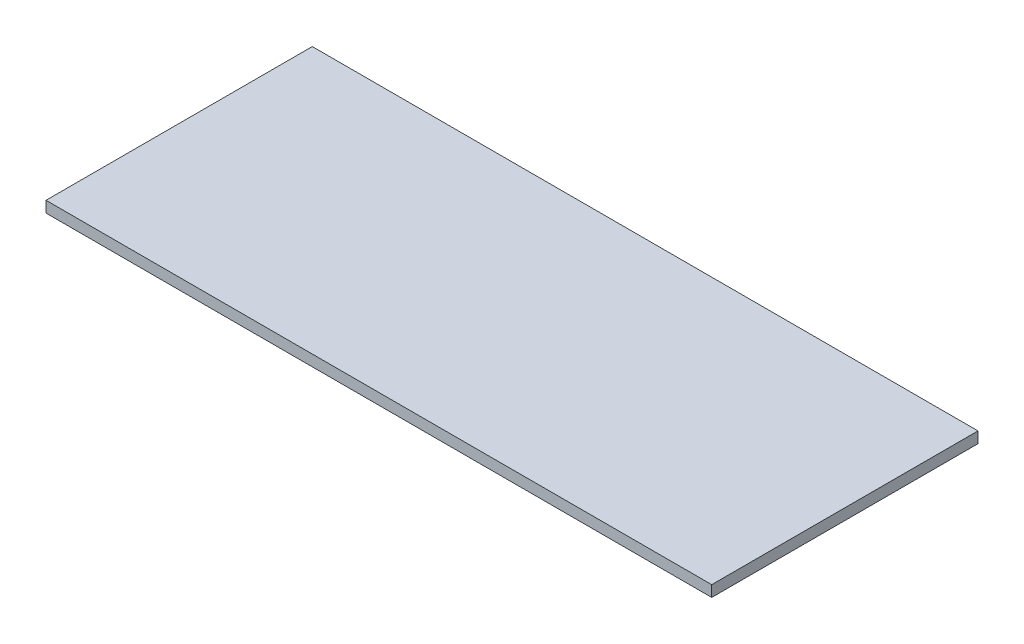
ISO-10303-21;
HEADER;
FILE_DESCRIPTION(('STEP AP214'),'2;1');
FILE_NAME('part.step','',(''),(''),'','','');
FILE_SCHEMA(('AUTOMOTIVE_DESIGN { 1 0 10303 214 1 1 1 1 }'));
ENDSEC;
DATA;
#1=APPLICATION_CONTEXT('core data for automotive mechanical design processes');
#2=APPLICATION_PROTOCOL_DEFINITION('international standard','automotive_design',2000,#1);
#3=PRODUCT_CONTEXT('',#1,'mechanical');
#4=PRODUCT('Part','Part','',(#3));
#5=PRODUCT_RELATED_PRODUCT_CATEGORY('part','',(#4));
#6=PRODUCT_DEFINITION_FORMATION('','',#4);
#7=PRODUCT_DEFINITION_CONTEXT('part definition',#1,'design');
#8=PRODUCT_DEFINITION('design','',#6,#7);
#9=PRODUCT_DEFINITION_SHAPE('','',#8);
#10=(LENGTH_UNIT() NAMED_UNIT(*) SI_UNIT(.MILLI.,.METRE.));
#11=(NAMED_UNIT(*) PLANE_ANGLE_UNIT() SI_UNIT($,.RADIAN.));
#12=(NAMED_UNIT(*) SI_UNIT($,.STERADIAN.) SOLID_ANGLE_UNIT());
#13=UNCERTAINTY_MEASURE_WITH_UNIT(LENGTH_MEASURE(1.E-05),#10,'distance_accuracy_value','');
#14=(GEOMETRIC_REPRESENTATION_CONTEXT(3) GLOBAL_UNCERTAINTY_ASSIGNED_CONTEXT((#13)) GLOBAL_UNIT_ASSIGNED_CONTEXT((#10,
#11,#12)) REPRESENTATION_CONTEXT('',''));
#15=CARTESIAN_POINT('',(0.,0.,0.));
#16=DIRECTION('',(0.,0.,1.));
#17=DIRECTION('',(1.,0.,0.));
#18=AXIS2_PLACEMENT_3D('',#15,#16,#17);
#19=CARTESIAN_POINT('',(19050.,635.,7620.));
#20=DIRECTION('',(-1.,0.,0.));
#21=DIRECTION('',(0.,0.,1.));
#22=AXIS2_PLACEMENT_3D('',#19,#20,#21);
#23=PLANE('',#22);
#24=DIRECTION('',(0.,0.,-1.));
#25=VECTOR('',#24,1.);
#26=CARTESIAN_POINT('',(19050.,0.,7620.));
#27=LINE('',#26,#25);
#28=CARTESIAN_POINT('',(19050.,0.,7620.));
#29=VERTEX_POINT('',#28);
#30=CARTESIAN_POINT('',(19050.,0.,-7620.));
#31=VERTEX_POINT('',#30);
#32=EDGE_CURVE('E107',#29,#31,#27,.T.);
#33=ORIENTED_EDGE('',*,*,#32,.T.);
#34=DIRECTION('',(0.,-1.,0.));
#35=VECTOR('',#34,1.);
#36=CARTESIAN_POINT('',(19050.,635.,-7620.));
#37=LINE('',#36,#35);
#38=CARTESIAN_POINT('',(19050.,635.,-7620.));
#39=VERTEX_POINT('',#38);
#40=EDGE_CURVE('E11',#39,#31,#37,.T.);
#41=ORIENTED_EDGE('',*,*,#40,.F.);
#42=DIRECTION('',(0.,0.,-1.));
#43=VECTOR('',#42,1.);
#44=CARTESIAN_POINT('',(19050.,635.,7620.));
#45=LINE('',#44,#43);
#46=CARTESIAN_POINT('',(19050.,635.,7620.));
#47=VERTEX_POINT('',#46);
#48=EDGE_CURVE('E91',#47,#39,#45,.T.);
#49=ORIENTED_EDGE('',*,*,#48,.F.);
#50=DIRECTION('',(0.,-1.,0.));
#51=VECTOR('',#50,1.);
#52=CARTESIAN_POINT('',(19050.,635.,7620.));
#53=LINE('',#52,#51);
#54=EDGE_CURVE('E103',#47,#29,#53,.T.);
#55=ORIENTED_EDGE('',*,*,#54,.T.);
#56=EDGE_LOOP('',(#33,#41,#49,#55));
#57=FACE_BOUND('',#56,.T.);
#58=ADVANCED_FACE('F39',(#57),#23,.F.);
#59=CARTESIAN_POINT('',(-19050.,635.,-7620.));
#60=DIRECTION('',(0.,0.,1.));
#61=DIRECTION('',(1.,0.,0.));
#62=AXIS2_PLACEMENT_3D('',#59,#60,#61);
#63=PLANE('',#62);
#64=DIRECTION('',(-1.,0.,0.));
#65=VECTOR('',#64,1.);
#66=CARTESIAN_POINT('',(-19050.,0.,-7620.));
#67=LINE('',#66,#65);
#68=CARTESIAN_POINT('',(-19050.,0.,-7620.));
#69=VERTEX_POINT('',#68);
#70=EDGE_CURVE('E96',#31,#69,#67,.T.);
#71=ORIENTED_EDGE('',*,*,#70,.T.);
#72=DIRECTION('',(0.,-1.,0.));
#73=VECTOR('',#72,1.);
#74=CARTESIAN_POINT('',(-19050.,635.,-7620.));
#75=LINE('',#74,#73);
#76=CARTESIAN_POINT('',(-19050.,635.,-7620.));
#77=VERTEX_POINT('',#76);
#78=EDGE_CURVE('E48',#77,#69,#75,.T.);
#79=ORIENTED_EDGE('',*,*,#78,.F.);
#80=DIRECTION('',(-1.,0.,0.));
#81=VECTOR('',#80,1.);
#82=CARTESIAN_POINT('',(-19050.,635.,-7620.));
#83=LINE('',#82,#81);
#84=EDGE_CURVE('E86',#39,#77,#83,.T.);
#85=ORIENTED_EDGE('',*,*,#84,.F.);
#86=ORIENTED_EDGE('',*,*,#40,.T.);
#87=EDGE_LOOP('',(#71,#79,#85,#86));
#88=FACE_BOUND('',#87,.T.);
#89=ADVANCED_FACE('F95',(#88),#63,.F.);
#90=CARTESIAN_POINT('',(-19050.,635.,7620.));
#91=DIRECTION('',(1.,0.,0.));
#92=DIRECTION('',(0.,0.,-1.));
#93=AXIS2_PLACEMENT_3D('',#90,#91,#92);
#94=PLANE('',#93);
#95=DIRECTION('',(0.,0.,1.));
#96=VECTOR('',#95,1.);
#97=CARTESIAN_POINT('',(-19050.,0.,7620.));
#98=LINE('',#97,#96);
#99=CARTESIAN_POINT('',(-19050.,0.,7620.));
#100=VERTEX_POINT('',#99);
#101=EDGE_CURVE('E73',#69,#100,#98,.T.);
#102=ORIENTED_EDGE('',*,*,#101,.T.);
#103=DIRECTION('',(0.,-1.,0.));
#104=VECTOR('',#103,1.);
#105=CARTESIAN_POINT('',(-19050.,635.,7620.));
#106=LINE('',#105,#104);
#107=CARTESIAN_POINT('',(-19050.,635.,7620.));
#108=VERTEX_POINT('',#107);
#109=EDGE_CURVE('E98',#108,#100,#106,.T.);
#110=ORIENTED_EDGE('',*,*,#109,.F.);
#111=DIRECTION('',(0.,0.,1.));
#112=VECTOR('',#111,1.);
#113=CARTESIAN_POINT('',(-19050.,635.,7620.));
#114=LINE('',#113,#112);
#115=EDGE_CURVE('E89',#77,#108,#114,.T.);
#116=ORIENTED_EDGE('',*,*,#115,.F.);
#117=ORIENTED_EDGE('',*,*,#78,.T.);
#118=EDGE_LOOP('',(#102,#110,#116,#117));
#119=FACE_BOUND('',#118,.T.);
#120=ADVANCED_FACE('F99',(#119),#94,.F.);
#121=CARTESIAN_POINT('',(-19050.,635.,7620.));
#122=DIRECTION('',(0.,0.,-1.));
#123=DIRECTION('',(-1.,0.,0.));
#124=AXIS2_PLACEMENT_3D('',#121,#122,#123);
#125=PLANE('',#124);
#126=DIRECTION('',(1.,0.,0.));
#127=VECTOR('',#126,1.);
#128=CARTESIAN_POINT('',(-19050.,0.,7620.));
#129=LINE('',#128,#127);
#130=EDGE_CURVE('E79',#100,#29,#129,.T.);
#131=ORIENTED_EDGE('',*,*,#130,.T.);
#132=ORIENTED_EDGE('',*,*,#54,.F.);
#133=DIRECTION('',(1.,0.,0.));
#134=VECTOR('',#133,1.);
#135=CARTESIAN_POINT('',(-19050.,635.,7620.));
#136=LINE('',#135,#134);
#137=EDGE_CURVE('E56',#108,#47,#136,.T.);
#138=ORIENTED_EDGE('',*,*,#137,.F.);
#139=ORIENTED_EDGE('',*,*,#109,.T.);
#140=EDGE_LOOP('',(#131,#132,#138,#139));
#141=FACE_BOUND('',#140,.T.);
#142=ADVANCED_FACE('F120',(#141),#125,.F.);
#143=CARTESIAN_POINT('',(0.,635.,0.));
#144=DIRECTION('',(0.,-1.,0.));
#145=DIRECTION('',(0.,0.,-1.));
#146=AXIS2_PLACEMENT_3D('',#143,#144,#145);
#147=PLANE('',#146);
#148=ORIENTED_EDGE('',*,*,#48,.T.);
#149=ORIENTED_EDGE('',*,*,#84,.T.);
#150=ORIENTED_EDGE('',*,*,#115,.T.);
#151=ORIENTED_EDGE('',*,*,#137,.T.);
#152=EDGE_LOOP('',(#148,#149,#150,#151));
#153=FACE_BOUND('',#152,.T.);
#154=ADVANCED_FACE('F87',(#153),#147,.F.);
#155=CARTESIAN_POINT('',(0.,0.,0.));
#156=DIRECTION('',(0.,-1.,0.));
#157=DIRECTION('',(0.,0.,-1.));
#158=AXIS2_PLACEMENT_3D('',#155,#156,#157);
#159=PLANE('',#158);
#160=ORIENTED_EDGE('',*,*,#32,.F.);
#161=ORIENTED_EDGE('',*,*,#130,.F.);
#162=ORIENTED_EDGE('',*,*,#101,.F.);
#163=ORIENTED_EDGE('',*,*,#70,.F.);
#164=EDGE_LOOP('',(#160,#161,#162,#163));
#165=FACE_BOUND('',#164,.T.);
#166=ADVANCED_FACE('F123',(#165),#159,.T.);
#167=CLOSED_SHELL('',(#58,#89,#120,#142,#154,#166));
#168=MANIFOLD_SOLID_BREP('B2',#167);
#169=ADVANCED_BREP_SHAPE_REPRESENTATION('',(#18,#168),#14);
#170=SHAPE_DEFINITION_REPRESENTATION(#9,#169);
ENDSEC;
END-ISO-10303-21;
